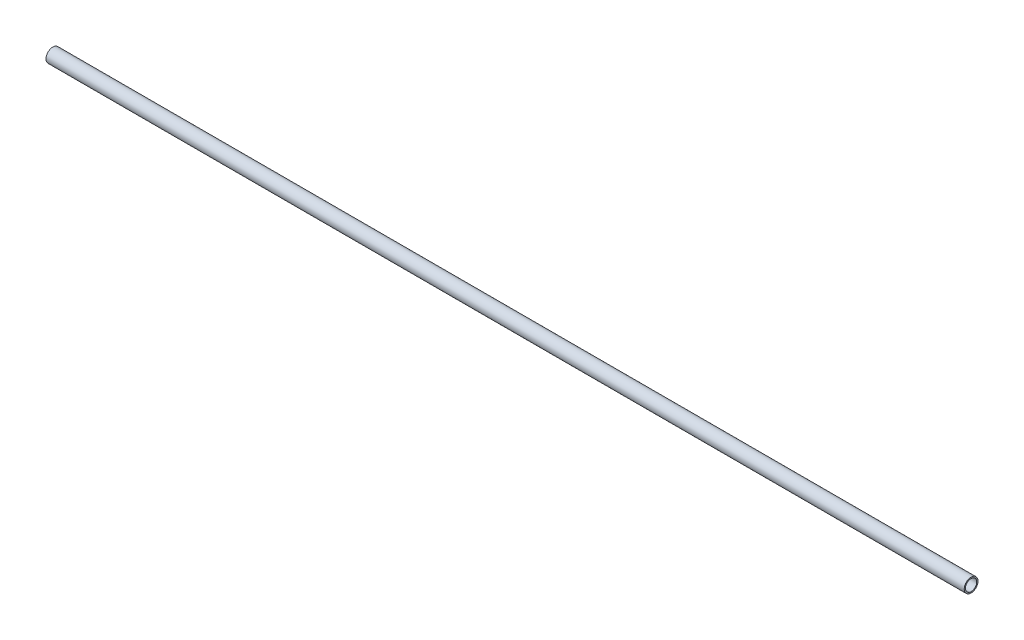
ISO-10303-21;
HEADER;
FILE_DESCRIPTION(('STEP AP214'),'2;1');
FILE_NAME('part.step','',(''),(''),'','','');
FILE_SCHEMA(('AUTOMOTIVE_DESIGN { 1 0 10303 214 1 1 1 1 }'));
ENDSEC;
DATA;
#1=APPLICATION_CONTEXT('core data for automotive mechanical design processes');
#2=APPLICATION_PROTOCOL_DEFINITION('international standard','automotive_design',2000,#1);
#3=PRODUCT_CONTEXT('',#1,'mechanical');
#4=PRODUCT('Part','Part','',(#3));
#5=PRODUCT_RELATED_PRODUCT_CATEGORY('part','',(#4));
#6=PRODUCT_DEFINITION_FORMATION('','',#4);
#7=PRODUCT_DEFINITION_CONTEXT('part definition',#1,'design');
#8=PRODUCT_DEFINITION('design','',#6,#7);
#9=PRODUCT_DEFINITION_SHAPE('','',#8);
#10=(LENGTH_UNIT() NAMED_UNIT(*) SI_UNIT(.MILLI.,.METRE.));
#11=(NAMED_UNIT(*) PLANE_ANGLE_UNIT() SI_UNIT($,.RADIAN.));
#12=(NAMED_UNIT(*) SI_UNIT($,.STERADIAN.) SOLID_ANGLE_UNIT());
#13=UNCERTAINTY_MEASURE_WITH_UNIT(LENGTH_MEASURE(1.E-05),#10,'distance_accuracy_value','');
#14=(GEOMETRIC_REPRESENTATION_CONTEXT(3) GLOBAL_UNCERTAINTY_ASSIGNED_CONTEXT((#13)) GLOBAL_UNIT_ASSIGNED_CONTEXT((#10,
#11,#12)) REPRESENTATION_CONTEXT('',''));
#15=CARTESIAN_POINT('',(0.,0.,0.));
#16=DIRECTION('',(0.,0.,1.));
#17=DIRECTION('',(1.,0.,0.));
#18=AXIS2_PLACEMENT_3D('',#15,#16,#17);
#19=CARTESIAN_POINT('',(0.,0.,0.));
#20=DIRECTION('',(1.,0.,0.));
#21=DIRECTION('',(0.,0.,-1.));
#22=AXIS2_PLACEMENT_3D('',#19,#20,#21);
#23=CYLINDRICAL_SURFACE('',#22,30.7);
#24=CARTESIAN_POINT('',(0.,0.,0.));
#25=DIRECTION('',(1.,0.,0.));
#26=DIRECTION('',(0.,0.,-1.));
#27=AXIS2_PLACEMENT_3D('',#24,#25,#26);
#28=CIRCLE('',#27,30.7);
#29=CARTESIAN_POINT('',(0.,0.,-30.7));
#30=VERTEX_POINT('',#29);
#31=EDGE_CURVE('E16',#30,#30,#28,.T.);
#32=ORIENTED_EDGE('',*,*,#31,.F.);
#33=EDGE_LOOP('',(#32));
#34=FACE_BOUND('',#33,.T.);
#35=CARTESIAN_POINT('',(5000.,0.,0.));
#36=DIRECTION('',(1.,0.,0.));
#37=DIRECTION('',(0.,0.,-1.));
#38=AXIS2_PLACEMENT_3D('',#35,#36,#37);
#39=CIRCLE('',#38,30.7);
#40=CARTESIAN_POINT('',(5000.,0.,-30.7));
#41=VERTEX_POINT('',#40);
#42=EDGE_CURVE('E25',#41,#41,#39,.F.);
#43=ORIENTED_EDGE('',*,*,#42,.F.);
#44=EDGE_LOOP('',(#43));
#45=FACE_BOUND('',#44,.T.);
#46=ADVANCED_FACE('F13',(#34,#45),#23,.F.);
#47=CARTESIAN_POINT('',(0.,-37.9500021082962,-37.5));
#48=DIRECTION('',(-1.,0.,0.));
#49=DIRECTION('',(0.,0.,1.));
#50=AXIS2_PLACEMENT_3D('',#47,#48,#49);
#51=PLANE('',#50);
#52=ORIENTED_EDGE('',*,*,#31,.T.);
#53=EDGE_LOOP('',(#52));
#54=FACE_BOUND('',#53,.T.);
#55=CARTESIAN_POINT('',(0.,0.,0.));
#56=DIRECTION('',(1.,0.,0.));
#57=DIRECTION('',(0.,0.,-1.));
#58=AXIS2_PLACEMENT_3D('',#55,#56,#57);
#59=CIRCLE('',#58,37.5);
#60=CARTESIAN_POINT('',(0.,0.,-37.5));
#61=VERTEX_POINT('',#60);
#62=EDGE_CURVE('E20',#61,#61,#59,.T.);
#63=ORIENTED_EDGE('',*,*,#62,.F.);
#64=EDGE_LOOP('',(#63));
#65=FACE_BOUND('',#64,.T.);
#66=ADVANCED_FACE('F33',(#54,#65),#51,.T.);
#67=CARTESIAN_POINT('',(5000.,-37.9500021082962,37.5));
#68=DIRECTION('',(1.,0.,0.));
#69=DIRECTION('',(0.,0.,-1.));
#70=AXIS2_PLACEMENT_3D('',#67,#68,#69);
#71=PLANE('',#70);
#72=ORIENTED_EDGE('',*,*,#42,.T.);
#73=EDGE_LOOP('',(#72));
#74=FACE_BOUND('',#73,.T.);
#75=CARTESIAN_POINT('',(5000.,0.,0.));
#76=DIRECTION('',(1.,0.,0.));
#77=DIRECTION('',(0.,0.,-1.));
#78=AXIS2_PLACEMENT_3D('',#75,#76,#77);
#79=CIRCLE('',#78,37.5);
#80=CARTESIAN_POINT('',(5000.,0.,-37.5));
#81=VERTEX_POINT('',#80);
#82=EDGE_CURVE('E8',#81,#81,#79,.F.);
#83=ORIENTED_EDGE('',*,*,#82,.F.);
#84=EDGE_LOOP('',(#83));
#85=FACE_BOUND('',#84,.T.);
#86=ADVANCED_FACE('F42',(#74,#85),#71,.T.);
#87=CARTESIAN_POINT('',(5000.,0.,0.));
#88=DIRECTION('',(1.,0.,0.));
#89=DIRECTION('',(0.,0.,-1.));
#90=AXIS2_PLACEMENT_3D('',#87,#88,#89);
#91=CYLINDRICAL_SURFACE('',#90,37.5);
#92=ORIENTED_EDGE('',*,*,#62,.T.);
#93=EDGE_LOOP('',(#92));
#94=FACE_BOUND('',#93,.T.);
#95=ORIENTED_EDGE('',*,*,#82,.T.);
#96=EDGE_LOOP('',(#95));
#97=FACE_BOUND('',#96,.T.);
#98=ADVANCED_FACE('F43',(#94,#97),#91,.T.);
#99=CLOSED_SHELL('',(#46,#66,#86,#98));
#100=MANIFOLD_SOLID_BREP('B1',#99);
#101=ADVANCED_BREP_SHAPE_REPRESENTATION('',(#18,#100),#14);
#102=SHAPE_DEFINITION_REPRESENTATION(#9,#101);
ENDSEC;
END-ISO-10303-21;
